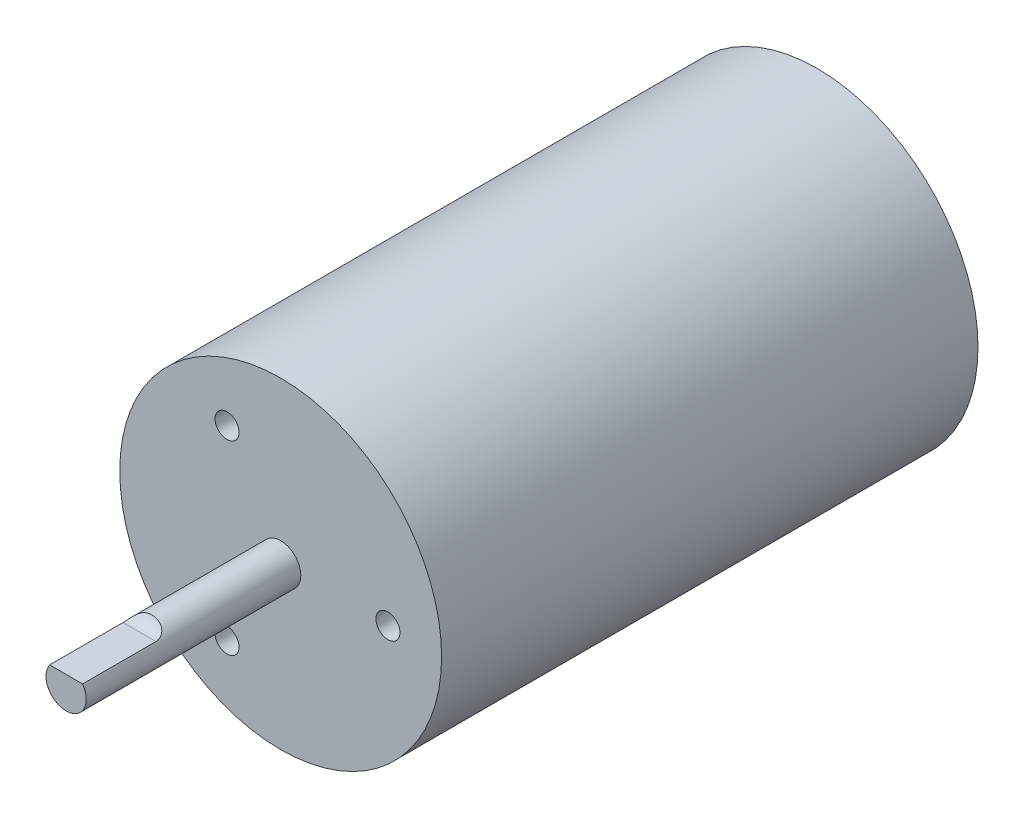
ISO-10303-21;
HEADER;
FILE_DESCRIPTION(('STEP AP214'),'2;1');
FILE_NAME('part.step','',(''),(''),'','','');
FILE_SCHEMA(('AUTOMOTIVE_DESIGN { 1 0 10303 214 1 1 1 1 }'));
ENDSEC;
DATA;
#1=APPLICATION_CONTEXT('core data for automotive mechanical design processes');
#2=APPLICATION_PROTOCOL_DEFINITION('international standard','automotive_design',2000,#1);
#3=PRODUCT_CONTEXT('',#1,'mechanical');
#4=PRODUCT('Part','Part','',(#3));
#5=PRODUCT_RELATED_PRODUCT_CATEGORY('part','',(#4));
#6=PRODUCT_DEFINITION_FORMATION('','',#4);
#7=PRODUCT_DEFINITION_CONTEXT('part definition',#1,'design');
#8=PRODUCT_DEFINITION('design','',#6,#7);
#9=PRODUCT_DEFINITION_SHAPE('','',#8);
#10=(LENGTH_UNIT() NAMED_UNIT(*) SI_UNIT(.MILLI.,.METRE.));
#11=(NAMED_UNIT(*) PLANE_ANGLE_UNIT() SI_UNIT($,.RADIAN.));
#12=(NAMED_UNIT(*) SI_UNIT($,.STERADIAN.) SOLID_ANGLE_UNIT());
#13=UNCERTAINTY_MEASURE_WITH_UNIT(LENGTH_MEASURE(1.E-05),#10,'distance_accuracy_value','');
#14=(GEOMETRIC_REPRESENTATION_CONTEXT(3) GLOBAL_UNCERTAINTY_ASSIGNED_CONTEXT((#13)) GLOBAL_UNIT_ASSIGNED_CONTEXT((#10,
#11,#12)) REPRESENTATION_CONTEXT('',''));
#15=CARTESIAN_POINT('',(0.,0.,0.));
#16=DIRECTION('',(0.,0.,1.));
#17=DIRECTION('',(1.,0.,0.));
#18=AXIS2_PLACEMENT_3D('',#15,#16,#17);
#19=CARTESIAN_POINT('',(0.,0.,25.4));
#20=DIRECTION('',(0.,0.,-1.));
#21=DIRECTION('',(-1.,0.,0.));
#22=AXIS2_PLACEMENT_3D('',#19,#20,#21);
#23=CYLINDRICAL_SURFACE('',#22,2.38125);
#24=CARTESIAN_POINT('',(0.,0.,0.));
#25=DIRECTION('',(0.,0.,1.));
#26=DIRECTION('',(1.,0.,0.));
#27=AXIS2_PLACEMENT_3D('',#24,#25,#26);
#28=CIRCLE('',#27,2.38125);
#29=CARTESIAN_POINT('',(2.38125,0.,0.));
#30=VERTEX_POINT('',#29);
#31=EDGE_CURVE('E121',#30,#30,#28,.T.);
#32=ORIENTED_EDGE('',*,*,#31,.T.);
#33=EDGE_LOOP('',(#32));
#34=FACE_BOUND('',#33,.T.);
#35=DIRECTION('',(0.,0.,-1.));
#36=VECTOR('',#35,1.);
#37=CARTESIAN_POINT('',(1.95101101995863,1.36525,25.4));
#38=LINE('',#37,#36);
#39=CARTESIAN_POINT('',(1.95101101995862,1.36525,25.4));
#40=VERTEX_POINT('',#39);
#41=CARTESIAN_POINT('',(1.95101101995863,1.36525,16.7145579900178));
#42=VERTEX_POINT('',#41);
#43=EDGE_CURVE('E118',#40,#42,#38,.T.);
#44=ORIENTED_EDGE('',*,*,#43,.F.);
#45=CARTESIAN_POINT('',(0.,0.,25.4));
#46=DIRECTION('',(0.,0.,1.));
#47=DIRECTION('',(1.,0.,0.));
#48=AXIS2_PLACEMENT_3D('',#45,#46,#47);
#49=CIRCLE('',#48,2.38125);
#50=CARTESIAN_POINT('',(-1.95101101995863,1.36525,25.4));
#51=VERTEX_POINT('',#50);
#52=EDGE_CURVE('E124',#51,#40,#49,.T.);
#53=ORIENTED_EDGE('',*,*,#52,.F.);
#54=DIRECTION('',(0.,0.,-1.));
#55=VECTOR('',#54,1.);
#56=CARTESIAN_POINT('',(-1.95101101995863,1.36525,25.4));
#57=LINE('',#56,#55);
#58=CARTESIAN_POINT('',(-1.95101101995863,1.36525,16.7145579900178));
#59=VERTEX_POINT('',#58);
#60=EDGE_CURVE('E52',#59,#51,#57,.F.);
#61=ORIENTED_EDGE('',*,*,#60,.F.);
#62=CARTESIAN_POINT('',(0.,2.38125,18.2021338604154));
#63=CARTESIAN_POINT('',(0.0676337390892533,2.38125004038805,18.2021340301931));
#64=CARTESIAN_POINT('',(0.135269511029242,2.37836555789325,18.2010306236303));
#65=CARTESIAN_POINT('',(0.270011360928685,2.36685874309445,18.1965130613484));
#66=CARTESIAN_POINT('',(0.337117123411539,2.35823322088689,18.1930976209721));
#67=CARTESIAN_POINT('',(0.470257837474709,2.33533172721854,18.183640662292));
#68=CARTESIAN_POINT('',(0.536291474315607,2.32104929415824,18.177596140145));
#69=CARTESIAN_POINT('',(0.66653589993214,2.28705362939443,18.162373995333));
#70=CARTESIAN_POINT('',(0.730747514163267,2.26734290171695,18.1531978168086));
#71=CARTESIAN_POINT('',(0.88660018088489,2.21223044891665,18.1257625793209));
#72=CARTESIAN_POINT('',(0.976824193453154,2.17381898366358,18.1052599970066));
#73=CARTESIAN_POINT('',(1.14920263009543,2.08780234529021,18.05319043776));
#74=CARTESIAN_POINT('',(1.23137509285807,2.04021846693878,18.02164895314));
#75=CARTESIAN_POINT('',(1.37109639269111,1.94836725432783,17.9515525632758));
#76=CARTESIAN_POINT('',(1.43041264999228,1.90505142677011,17.9152910084767));
#77=CARTESIAN_POINT('',(1.54029797286534,1.81735164799252,17.8322342170101));
#78=CARTESIAN_POINT('',(1.59087051316971,1.77296812909531,17.785443181826));
#79=CARTESIAN_POINT('',(1.6823817468959,1.68639975259534,17.680843153957));
#80=CARTESIAN_POINT('',(1.72326674225026,1.64422811476951,17.6229758216141));
#81=CARTESIAN_POINT('',(1.7946071174476,1.5660631107048,17.4974364784272));
#82=CARTESIAN_POINT('',(1.82506398055243,1.53006886617818,17.4297658639188));
#83=CARTESIAN_POINT('',(1.87336999193195,1.47043209417024,17.2937014834466));
#84=CARTESIAN_POINT('',(1.89215407693118,1.44593127697069,17.2260115984628));
#85=CARTESIAN_POINT('',(1.9219202362663,1.40612822191781,17.0863458446711));
#86=CARTESIAN_POINT('',(1.93290276275456,1.39082545098425,17.0143702245122));
#87=CARTESIAN_POINT('',(1.9473313333111,1.37054914050015,16.8696573421284));
#88=CARTESIAN_POINT('',(1.95091629480561,1.36538529574901,16.7969603816717));
#89=CARTESIAN_POINT('',(1.9511199588155,1.36509439238449,16.6515363047512));
#90=CARTESIAN_POINT('',(1.94773877377115,1.36996717177041,16.578809188793));
#91=CARTESIAN_POINT('',(1.93382894933259,1.3895324656453,16.4349851190824));
#92=CARTESIAN_POINT('',(1.92326232304367,1.40427716306186,16.3638989158012));
#93=CARTESIAN_POINT('',(1.89455959938443,1.44276376248764,16.2258170097998));
#94=CARTESIAN_POINT('',(1.876424807457,1.46650411275984,16.1588206039085));
#95=CARTESIAN_POINT('',(1.83225350350026,1.5213231148118,16.0311285876231));
#96=CARTESIAN_POINT('',(1.80625669773554,1.55236472122393,15.9704033263711));
#97=CARTESIAN_POINT('',(1.74609923050631,1.61972821743737,15.8564111440915));
#98=CARTESIAN_POINT('',(1.71193971958711,1.65604936279752,15.8031431736243));
#99=CARTESIAN_POINT('',(1.6352650384023,1.73181525398459,15.7044954263309));
#100=CARTESIAN_POINT('',(1.59267222383557,1.77128682104026,15.6591969549095));
#101=CARTESIAN_POINT('',(1.50001394356688,1.85041147125619,15.5772631620321));
#102=CARTESIAN_POINT('',(1.44994585193904,1.89006461343658,15.5406308965872));
#103=CARTESIAN_POINT('',(1.33867697141842,1.97063756747771,15.4726026413069));
#104=CARTESIAN_POINT('',(1.2768845733783,2.01136260797288,15.4419494138771));
#105=CARTESIAN_POINT('',(1.14715399927818,2.08808165520601,15.3888851380576));
#106=CARTESIAN_POINT('',(1.07921203002995,2.12407270788088,15.3664792205503));
#107=CARTESIAN_POINT('',(0.925450944887935,2.19598984542352,15.3248090348767));
#108=CARTESIAN_POINT('',(0.838665978771189,2.23064285447445,15.3069177740739));
#109=CARTESIAN_POINT('',(0.660561821115633,2.28972464018676,15.2782759624298));
#110=CARTESIAN_POINT('',(0.569239564749793,2.31414639790945,15.2675303107276));
#111=CARTESIAN_POINT('',(0.365579121000406,2.35574290345574,15.2498849823858));
#112=CARTESIAN_POINT('',(0.252649188677733,2.37053740161292,15.2441622920506));
#113=CARTESIAN_POINT('',(0.0255759890467969,2.38382869735669,15.2389891098672));
#114=CARTESIAN_POINT('',(-0.0885682507770203,2.3823112663561,15.2395440939378));
#115=CARTESIAN_POINT('',(-0.263669697596858,2.36742333165003,15.2454046400106));
#116=CARTESIAN_POINT('',(-0.325244182592446,2.35974759264995,15.2484387693907));
#117=CARTESIAN_POINT('',(-0.447489306463699,2.33964483655482,15.2566908512497));
#118=CARTESIAN_POINT('',(-0.508159811480049,2.32721712292179,15.2619091238879));
#119=CARTESIAN_POINT('',(-0.628061889552236,2.29775925601969,15.2748929819252));
#120=CARTESIAN_POINT('',(-0.687294287366122,2.28073181207507,15.2826570683677));
#121=CARTESIAN_POINT('',(-0.803811247876481,2.24232141891076,15.3012361233809));
#122=CARTESIAN_POINT('',(-0.861096405207311,2.22093981353331,15.3120501510315));
#123=CARTESIAN_POINT('',(-1.0030491529141,2.16168413667972,15.3440892940988));
#124=CARTESIAN_POINT('',(-1.08606887201268,2.12108800042828,15.3677924053669));
#125=CARTESIAN_POINT('',(-1.24380132150032,2.03259846016371,15.42634827397));
#126=CARTESIAN_POINT('',(-1.3185279968726,1.98471763723567,15.4611819201893));
#127=CARTESIAN_POINT('',(-1.44590576237233,1.89336198556923,15.5375083843671));
#128=CARTESIAN_POINT('',(-1.50016769725143,1.85045099162037,15.5769744294605));
#129=CARTESIAN_POINT('',(-1.59992011436614,1.76491369433418,15.6660624600443));
#130=CARTESIAN_POINT('',(-1.64541402601793,1.72228728601084,15.7156804591061));
#131=CARTESIAN_POINT('',(-1.72699779177844,1.64048611648962,15.8250586004782));
#132=CARTESIAN_POINT('',(-1.76304647485138,1.60132694359926,15.8848613298396));
#133=CARTESIAN_POINT('',(-1.82534507835508,1.52994313602238,16.0131153421078));
#134=CARTESIAN_POINT('',(-1.85159478234316,1.497718654518,16.081566816006));
#135=CARTESIAN_POINT('',(-1.89300856860936,1.44496016409858,16.2192920748628));
#136=CARTESIAN_POINT('',(-1.90888049778225,1.42370761609776,16.2880805176647));
#137=CARTESIAN_POINT('',(-1.93311594986609,1.39062526166919,16.4291562372548));
#138=CARTESIAN_POINT('',(-1.94147986789517,1.3787949593881,16.5014433297115));
#139=CARTESIAN_POINT('',(-1.95098399307532,1.36531351806619,16.6467555353043));
#140=CARTESIAN_POINT('',(-1.95218918988168,1.36357080368637,16.7197679618902));
#141=CARTESIAN_POINT('',(-1.9476026893249,1.3701134412389,16.8651213227609));
#142=CARTESIAN_POINT('',(-1.94181110765418,1.37839862735895,16.9374622681287));
#143=CARTESIAN_POINT('',(-1.92295321948591,1.40458590919274,17.0797271750206));
#144=CARTESIAN_POINT('',(-1.90985652758389,1.42252816220973,17.1496397368537));
#145=CARTESIAN_POINT('',(-1.87593971989845,1.46696193869372,17.2846988748934));
#146=CARTESIAN_POINT('',(-1.85512126580502,1.49345162263098,17.3498464728913));
#147=CARTESIAN_POINT('',(-1.80550073151972,1.55306326989195,17.4732225423686));
#148=CARTESIAN_POINT('',(-1.77674533164452,1.5861461491119,17.5314887095193));
#149=CARTESIAN_POINT('',(-1.71109243185906,1.65675286045595,17.6401893339891));
#150=CARTESIAN_POINT('',(-1.67419532493578,1.69427647819228,17.6906241691137));
#151=CARTESIAN_POINT('',(-1.59185229532183,1.77189431388369,17.7838555364103));
#152=CARTESIAN_POINT('',(-1.5462619751101,1.81202305914972,17.8264949880159));
#153=CARTESIAN_POINT('',(-1.44782512602837,1.89160336407494,17.9031036877713));
#154=CARTESIAN_POINT('',(-1.39497610275647,1.93105468567645,17.9370699439168));
#155=CARTESIAN_POINT('',(-1.27721453127501,2.01113423584475,18.0002927703995));
#156=CARTESIAN_POINT('',(-1.21161712248837,2.05144445278522,18.0286693166908));
#157=CARTESIAN_POINT('',(-1.07449080376152,2.1264876711186,18.0773388754597));
#158=CARTESIAN_POINT('',(-1.00295632002388,2.16121533965296,18.0976241856707));
#159=CARTESIAN_POINT('',(-0.840803145836919,2.22993580009133,18.1351201135437));
#160=CARTESIAN_POINT('',(-0.74921692496152,2.2624111552077,18.1509186541577));
#161=CARTESIAN_POINT('',(-0.561984057189917,2.3160338022742,18.1755904856698));
#162=CARTESIAN_POINT('',(-0.466339804690519,2.33718767671616,18.1844678020539));
#163=CARTESIAN_POINT('',(-0.308621116617282,2.36197563320509,18.194584575773));
#164=CARTESIAN_POINT('',(-0.247181583678173,2.36919414201254,18.1974336338092));
#165=CARTESIAN_POINT('',(-0.123828755529014,2.37883256139703,18.2012087011461));
#166=CARTESIAN_POINT('',(-0.0619152295763523,2.38124996302681,18.2021337049926));
#167=CARTESIAN_POINT('',(0.,2.38125,18.2021338604154));
#168=B_SPLINE_CURVE_WITH_KNOTS('',3,(#62,#63,#64,#65,#66,#67,#68,#69,#70,#71,#72,#73,#74,#75,
#76,#77,#78,#79,#80,#81,#82,#83,#84,#85,#86,#87,#88,#89,#90,#91,#92,#93,#94,#95,#96,#97,#98,#99,
#100,#101,#102,#103,#104,#105,#106,#107,#108,#109,#110,#111,#112,#113,#114,#115,#116,#117,#118,
#119,#120,#121,#122,#123,#124,#125,#126,#127,#128,#129,#130,#131,#132,#133,#134,#135,#136,#137,
#138,#139,#140,#141,#142,#143,#144,#145,#146,#147,#148,#149,#150,#151,#152,#153,#154,#155,#156,
#157,#158,#159,#160,#161,#162,#163,#164,#165,#166,#167),.UNSPECIFIED.,.T.,.F.,(4,2,2,2,2,2,2,2,
2,2,2,2,2,2,2,2,2,2,2,2,2,2,2,2,2,2,2,2,2,2,2,2,2,2,2,2,2,2,2,2,2,2,2,2,2,2,2,2,2,2,2,2,4),(0.,
0.202833529407158,0.405779853736744,0.608958664904554,0.812043907955549,1.11134164679719,
1.40995272427208,1.65466777135272,1.89928534460164,2.14522867249997,2.39113700371424,
2.61324514392157,2.83534041042994,3.05322556994325,3.27110721260958,3.49014976670914,
3.70915455347579,3.92707124495892,4.14495723886231,4.36495130295655,4.58502282949817,
4.82442842390453,5.06398270850466,5.34837534744,5.63296276984527,5.97369493793818,
6.31472434435473,6.50090828324036,6.6871195231825,6.8732213195899,7.05926576547058,
7.34429833212378,7.62884410447092,7.86675926175323,8.10458117415067,8.34342310834323,
8.58227031783353,8.80238918041606,9.022496458299,9.24060242510722,9.45870478556112,
9.67772117554678,9.89669046146703,10.1143983798147,10.3320957920527,10.5537864643054,
10.7755535104888,11.0208120803435,11.2663035644509,11.5605794376572,11.8546840277285,
12.0402707938341,12.2259545177881),.UNSPECIFIED.);
#169=EDGE_CURVE('E11',#42,#59,#168,.T.);
#170=ORIENTED_EDGE('',*,*,#169,.F.);
#171=EDGE_LOOP('',(#44,#53,#61,#170));
#172=FACE_BOUND('',#171,.T.);
#173=ADVANCED_FACE('F33',(#34,#172),#23,.T.);
#174=CARTESIAN_POINT('',(0.,0.,25.4));
#175=DIRECTION('',(0.,0.,1.));
#176=DIRECTION('',(1.,0.,0.));
#177=AXIS2_PLACEMENT_3D('',#174,#175,#176);
#178=PLANE('',#177);
#179=ORIENTED_EDGE('',*,*,#52,.T.);
#180=DIRECTION('',(-1.,0.,0.));
#181=VECTOR('',#180,1.);
#182=CARTESIAN_POINT('',(0.,1.36525,25.4));
#183=LINE('',#182,#181);
#184=EDGE_CURVE('E45',#40,#51,#183,.T.);
#185=ORIENTED_EDGE('',*,*,#184,.T.);
#186=EDGE_LOOP('',(#179,#185));
#187=FACE_BOUND('',#186,.T.);
#188=ADVANCED_FACE('F134',(#187),#178,.T.);
#189=CARTESIAN_POINT('',(0.,0.,0.));
#190=DIRECTION('',(0.,0.,1.));
#191=DIRECTION('',(1.,0.,0.));
#192=AXIS2_PLACEMENT_3D('',#189,#190,#191);
#193=PLANE('',#192);
#194=CARTESIAN_POINT('',(-6.3499999999999,-10.9985226280624,0.));
#195=DIRECTION('',(0.,0.,1.));
#196=DIRECTION('',(1.,0.,0.));
#197=AXIS2_PLACEMENT_3D('',#194,#195,#196);
#198=CIRCLE('',#197,1.42239999999999);
#199=CARTESIAN_POINT('',(-4.9275999999999,-10.9985226280624,0.));
#200=VERTEX_POINT('',#199);
#201=EDGE_CURVE('E88',#200,#200,#198,.T.);
#202=ORIENTED_EDGE('',*,*,#201,.F.);
#203=EDGE_LOOP('',(#202));
#204=FACE_BOUND('',#203,.T.);
#205=CARTESIAN_POINT('',(-6.35000000000005,10.9985226280623,0.));
#206=DIRECTION('',(0.,0.,1.));
#207=DIRECTION('',(1.,0.,0.));
#208=AXIS2_PLACEMENT_3D('',#205,#206,#207);
#209=CIRCLE('',#208,1.42239999999999);
#210=CARTESIAN_POINT('',(-4.92760000000006,10.9985226280623,0.));
#211=VERTEX_POINT('',#210);
#212=EDGE_CURVE('E100',#211,#211,#209,.T.);
#213=ORIENTED_EDGE('',*,*,#212,.F.);
#214=EDGE_LOOP('',(#213));
#215=FACE_BOUND('',#214,.T.);
#216=CARTESIAN_POINT('',(12.7,0.,0.));
#217=DIRECTION('',(0.,0.,1.));
#218=DIRECTION('',(1.,0.,0.));
#219=AXIS2_PLACEMENT_3D('',#216,#217,#218);
#220=CIRCLE('',#219,1.42239999999999);
#221=CARTESIAN_POINT('',(14.1224,0.,0.));
#222=VERTEX_POINT('',#221);
#223=EDGE_CURVE('E112',#222,#222,#220,.T.);
#224=ORIENTED_EDGE('',*,*,#223,.F.);
#225=EDGE_LOOP('',(#224));
#226=FACE_BOUND('',#225,.T.);
#227=CARTESIAN_POINT('',(0.,0.,0.));
#228=DIRECTION('',(0.,0.,1.));
#229=DIRECTION('',(1.,0.,0.));
#230=AXIS2_PLACEMENT_3D('',#227,#228,#229);
#231=CIRCLE('',#230,19.05);
#232=CARTESIAN_POINT('',(19.05,0.,0.));
#233=VERTEX_POINT('',#232);
#234=EDGE_CURVE('E127',#233,#233,#231,.T.);
#235=ORIENTED_EDGE('',*,*,#234,.T.);
#236=EDGE_LOOP('',(#235));
#237=FACE_BOUND('',#236,.T.);
#238=ORIENTED_EDGE('',*,*,#31,.F.);
#239=EDGE_LOOP('',(#238));
#240=FACE_BOUND('',#239,.T.);
#241=ADVANCED_FACE('F155',(#204,#215,#226,#237,#240),#193,.T.);
#242=CARTESIAN_POINT('',(0.,0.,-63.5));
#243=DIRECTION('',(0.,0.,1.));
#244=DIRECTION('',(1.,0.,0.));
#245=AXIS2_PLACEMENT_3D('',#242,#243,#244);
#246=CYLINDRICAL_SURFACE('',#245,19.05);
#247=CARTESIAN_POINT('',(0.,0.,-63.5));
#248=DIRECTION('',(0.,0.,1.));
#249=DIRECTION('',(1.,0.,0.));
#250=AXIS2_PLACEMENT_3D('',#247,#248,#249);
#251=CIRCLE('',#250,19.05);
#252=CARTESIAN_POINT('',(19.05,0.,-63.5));
#253=VERTEX_POINT('',#252);
#254=EDGE_CURVE('E130',#253,#253,#251,.T.);
#255=ORIENTED_EDGE('',*,*,#254,.T.);
#256=EDGE_LOOP('',(#255));
#257=FACE_BOUND('',#256,.T.);
#258=ORIENTED_EDGE('',*,*,#234,.F.);
#259=EDGE_LOOP('',(#258));
#260=FACE_BOUND('',#259,.T.);
#261=ADVANCED_FACE('F35',(#257,#260),#246,.T.);
#262=CARTESIAN_POINT('',(0.,0.,-63.5));
#263=DIRECTION('',(0.,0.,1.));
#264=DIRECTION('',(1.,0.,0.));
#265=AXIS2_PLACEMENT_3D('',#262,#263,#264);
#266=PLANE('',#265);
#267=ORIENTED_EDGE('',*,*,#254,.F.);
#268=EDGE_LOOP('',(#267));
#269=FACE_BOUND('',#268,.T.);
#270=ADVANCED_FACE('F140',(#269),#266,.F.);
#271=CARTESIAN_POINT('',(153.754975253475,2.95273665622663,16.7210669302077));
#272=DIRECTION('',(-1.,0.,0.));
#273=DIRECTION('',(0.,0.,1.));
#274=AXIS2_PLACEMENT_3D('',#271,#272,#273);
#275=CYLINDRICAL_SURFACE('',#274,1.5875);
#276=DIRECTION('',(-1.,0.,0.));
#277=VECTOR('',#276,1.);
#278=CARTESIAN_POINT('',(153.754975253475,1.36525,16.7145579900178));
#279=LINE('',#278,#277);
#280=EDGE_CURVE('E115',#42,#59,#279,.T.);
#281=ORIENTED_EDGE('',*,*,#280,.F.);
#282=ORIENTED_EDGE('',*,*,#169,.T.);
#283=EDGE_LOOP('',(#281,#282));
#284=FACE_BOUND('',#283,.T.);
#285=ADVANCED_FACE('F138',(#284),#275,.F.);
#286=CARTESIAN_POINT('',(153.754975253475,1.36525,25.4));
#287=DIRECTION('',(0.,1.,0.));
#288=DIRECTION('',(0.,0.,1.));
#289=AXIS2_PLACEMENT_3D('',#286,#287,#288);
#290=PLANE('',#289);
#291=ORIENTED_EDGE('',*,*,#184,.F.);
#292=ORIENTED_EDGE('',*,*,#43,.T.);
#293=ORIENTED_EDGE('',*,*,#280,.T.);
#294=ORIENTED_EDGE('',*,*,#60,.T.);
#295=EDGE_LOOP('',(#291,#292,#293,#294));
#296=FACE_BOUND('',#295,.T.);
#297=ADVANCED_FACE('F137',(#296),#290,.T.);
#298=CARTESIAN_POINT('',(12.7,0.,0.));
#299=DIRECTION('',(0.,0.,1.));
#300=DIRECTION('',(1.,0.,0.));
#301=AXIS2_PLACEMENT_3D('',#298,#299,#300);
#302=CYLINDRICAL_SURFACE('',#301,1.42239999999999);
#303=CARTESIAN_POINT('',(12.7,0.,-5.6896));
#304=DIRECTION('',(0.,0.,1.));
#305=DIRECTION('',(1.,0.,0.));
#306=AXIS2_PLACEMENT_3D('',#303,#304,#305);
#307=CIRCLE('',#306,1.4224);
#308=CARTESIAN_POINT('',(14.1224,0.,-5.6896));
#309=VERTEX_POINT('',#308);
#310=EDGE_CURVE('E109',#309,#309,#307,.T.);
#311=ORIENTED_EDGE('',*,*,#310,.F.);
#312=EDGE_LOOP('',(#311));
#313=FACE_BOUND('',#312,.T.);
#314=ORIENTED_EDGE('',*,*,#223,.T.);
#315=EDGE_LOOP('',(#314));
#316=FACE_BOUND('',#315,.T.);
#317=ADVANCED_FACE('F145',(#313,#316),#302,.F.);
#318=CARTESIAN_POINT('',(13.8303,0.,-5.6896));
#319=DIRECTION('',(0.,0.,-1.));
#320=DIRECTION('',(-1.,0.,0.));
#321=AXIS2_PLACEMENT_3D('',#318,#319,#320);
#322=PLANE('',#321);
#323=CARTESIAN_POINT('',(12.7,0.,-5.6896));
#324=DIRECTION('',(0.,0.,1.));
#325=DIRECTION('',(1.,0.,0.));
#326=AXIS2_PLACEMENT_3D('',#323,#324,#325);
#327=CIRCLE('',#326,1.1303);
#328=CARTESIAN_POINT('',(13.8303,0.,-5.6896));
#329=VERTEX_POINT('',#328);
#330=EDGE_CURVE('E106',#329,#329,#327,.T.);
#331=ORIENTED_EDGE('',*,*,#330,.F.);
#332=EDGE_LOOP('',(#331));
#333=FACE_BOUND('',#332,.T.);
#334=ORIENTED_EDGE('',*,*,#310,.T.);
#335=EDGE_LOOP('',(#334));
#336=FACE_BOUND('',#335,.T.);
#337=ADVANCED_FACE('F177',(#333,#336),#322,.F.);
#338=CARTESIAN_POINT('',(12.7,0.,0.));
#339=DIRECTION('',(0.,0.,1.));
#340=DIRECTION('',(1.,0.,0.));
#341=AXIS2_PLACEMENT_3D('',#338,#339,#340);
#342=CYLINDRICAL_SURFACE('',#341,1.1303);
#343=CARTESIAN_POINT('',(12.7,0.,-8.8646));
#344=DIRECTION('',(0.,0.,1.));
#345=DIRECTION('',(1.,0.,0.));
#346=AXIS2_PLACEMENT_3D('',#343,#344,#345);
#347=CIRCLE('',#346,1.1303);
#348=CARTESIAN_POINT('',(13.8303,0.,-8.8646));
#349=VERTEX_POINT('',#348);
#350=EDGE_CURVE('E103',#349,#349,#347,.T.);
#351=ORIENTED_EDGE('',*,*,#350,.F.);
#352=EDGE_LOOP('',(#351));
#353=FACE_BOUND('',#352,.T.);
#354=ORIENTED_EDGE('',*,*,#330,.T.);
#355=EDGE_LOOP('',(#354));
#356=FACE_BOUND('',#355,.T.);
#357=ADVANCED_FACE('F182',(#353,#356),#342,.F.);
#358=CARTESIAN_POINT('',(12.7,0.,-8.8646));
#359=DIRECTION('',(0.,0.,1.));
#360=DIRECTION('',(1.,0.,0.));
#361=AXIS2_PLACEMENT_3D('',#358,#359,#360);
#362=CONICAL_SURFACE('',#361,1.1303,1.02974425867665);
#363=CARTESIAN_POINT('',(12.7,0.,-9.54375275768685));
#364=VERTEX_POINT('',#363);
#365=VERTEX_LOOP('',#364);
#366=FACE_BOUND('',#365,.T.);
#367=ORIENTED_EDGE('',*,*,#350,.T.);
#368=EDGE_LOOP('',(#367));
#369=FACE_BOUND('',#368,.T.);
#370=ADVANCED_FACE('F189',(#366,#369),#362,.F.);
#371=CARTESIAN_POINT('',(-6.35000000000005,10.9985226280623,0.));
#372=DIRECTION('',(0.,0.,1.));
#373=DIRECTION('',(1.,0.,0.));
#374=AXIS2_PLACEMENT_3D('',#371,#372,#373);
#375=CYLINDRICAL_SURFACE('',#374,1.42239999999999);
#376=CARTESIAN_POINT('',(-6.35000000000005,10.9985226280623,-5.6896));
#377=DIRECTION('',(0.,0.,1.));
#378=DIRECTION('',(1.,0.,0.));
#379=AXIS2_PLACEMENT_3D('',#376,#377,#378);
#380=CIRCLE('',#379,1.4224);
#381=CARTESIAN_POINT('',(-4.92760000000006,10.9985226280623,-5.6896));
#382=VERTEX_POINT('',#381);
#383=EDGE_CURVE('E97',#382,#382,#380,.T.);
#384=ORIENTED_EDGE('',*,*,#383,.F.);
#385=EDGE_LOOP('',(#384));
#386=FACE_BOUND('',#385,.T.);
#387=ORIENTED_EDGE('',*,*,#212,.T.);
#388=EDGE_LOOP('',(#387));
#389=FACE_BOUND('',#388,.T.);
#390=ADVANCED_FACE('F193',(#386,#389),#375,.F.);
#391=CARTESIAN_POINT('',(-5.21970000000005,10.9985226280623,-5.6896));
#392=DIRECTION('',(0.,0.,-1.));
#393=DIRECTION('',(-1.,0.,0.));
#394=AXIS2_PLACEMENT_3D('',#391,#392,#393);
#395=PLANE('',#394);
#396=CARTESIAN_POINT('',(-6.35000000000005,10.9985226280623,-5.6896));
#397=DIRECTION('',(0.,0.,1.));
#398=DIRECTION('',(1.,0.,0.));
#399=AXIS2_PLACEMENT_3D('',#396,#397,#398);
#400=CIRCLE('',#399,1.1303);
#401=CARTESIAN_POINT('',(-5.21970000000005,10.9985226280623,-5.6896));
#402=VERTEX_POINT('',#401);
#403=EDGE_CURVE('E94',#402,#402,#400,.T.);
#404=ORIENTED_EDGE('',*,*,#403,.F.);
#405=EDGE_LOOP('',(#404));
#406=FACE_BOUND('',#405,.T.);
#407=ORIENTED_EDGE('',*,*,#383,.T.);
#408=EDGE_LOOP('',(#407));
#409=FACE_BOUND('',#408,.T.);
#410=ADVANCED_FACE('F197',(#406,#409),#395,.F.);
#411=CARTESIAN_POINT('',(-6.35000000000005,10.9985226280623,0.));
#412=DIRECTION('',(0.,0.,1.));
#413=DIRECTION('',(1.,0.,0.));
#414=AXIS2_PLACEMENT_3D('',#411,#412,#413);
#415=CYLINDRICAL_SURFACE('',#414,1.1303);
#416=CARTESIAN_POINT('',(-6.35000000000005,10.9985226280623,-8.8646));
#417=DIRECTION('',(0.,0.,1.));
#418=DIRECTION('',(1.,0.,0.));
#419=AXIS2_PLACEMENT_3D('',#416,#417,#418);
#420=CIRCLE('',#419,1.1303);
#421=CARTESIAN_POINT('',(-5.21970000000005,10.9985226280623,-8.8646));
#422=VERTEX_POINT('',#421);
#423=EDGE_CURVE('E91',#422,#422,#420,.T.);
#424=ORIENTED_EDGE('',*,*,#423,.F.);
#425=EDGE_LOOP('',(#424));
#426=FACE_BOUND('',#425,.T.);
#427=ORIENTED_EDGE('',*,*,#403,.T.);
#428=EDGE_LOOP('',(#427));
#429=FACE_BOUND('',#428,.T.);
#430=ADVANCED_FACE('F201',(#426,#429),#415,.F.);
#431=CARTESIAN_POINT('',(-6.35000000000005,10.9985226280623,-8.8646));
#432=DIRECTION('',(0.,0.,1.));
#433=DIRECTION('',(1.,0.,0.));
#434=AXIS2_PLACEMENT_3D('',#431,#432,#433);
#435=CONICAL_SURFACE('',#434,1.1303,1.02974425867665);
#436=CARTESIAN_POINT('',(-6.35000000000005,10.9985226280623,-9.54375275768685));
#437=VERTEX_POINT('',#436);
#438=VERTEX_LOOP('',#437);
#439=FACE_BOUND('',#438,.T.);
#440=ORIENTED_EDGE('',*,*,#423,.T.);
#441=EDGE_LOOP('',(#440));
#442=FACE_BOUND('',#441,.T.);
#443=ADVANCED_FACE('F205',(#439,#442),#435,.F.);
#444=CARTESIAN_POINT('',(-6.3499999999999,-10.9985226280624,0.));
#445=DIRECTION('',(0.,0.,1.));
#446=DIRECTION('',(1.,0.,0.));
#447=AXIS2_PLACEMENT_3D('',#444,#445,#446);
#448=CYLINDRICAL_SURFACE('',#447,1.42239999999999);
#449=CARTESIAN_POINT('',(-6.3499999999999,-10.9985226280624,-5.6896));
#450=DIRECTION('',(0.,0.,1.));
#451=DIRECTION('',(1.,0.,0.));
#452=AXIS2_PLACEMENT_3D('',#449,#450,#451);
#453=CIRCLE('',#452,1.4224);
#454=CARTESIAN_POINT('',(-4.9275999999999,-10.9985226280624,-5.6896));
#455=VERTEX_POINT('',#454);
#456=EDGE_CURVE('E83',#455,#455,#453,.T.);
#457=ORIENTED_EDGE('',*,*,#456,.F.);
#458=EDGE_LOOP('',(#457));
#459=FACE_BOUND('',#458,.T.);
#460=ORIENTED_EDGE('',*,*,#201,.T.);
#461=EDGE_LOOP('',(#460));
#462=FACE_BOUND('',#461,.T.);
#463=ADVANCED_FACE('F209',(#459,#462),#448,.F.);
#464=CARTESIAN_POINT('',(-5.2196999999999,-10.9985226280624,-5.6896));
#465=DIRECTION('',(0.,0.,-1.));
#466=DIRECTION('',(-1.,0.,0.));
#467=AXIS2_PLACEMENT_3D('',#464,#465,#466);
#468=PLANE('',#467);
#469=CARTESIAN_POINT('',(-6.3499999999999,-10.9985226280624,-5.6896));
#470=DIRECTION('',(0.,0.,1.));
#471=DIRECTION('',(1.,0.,0.));
#472=AXIS2_PLACEMENT_3D('',#469,#470,#471);
#473=CIRCLE('',#472,1.1303);
#474=CARTESIAN_POINT('',(-5.2196999999999,-10.9985226280624,-5.6896));
#475=VERTEX_POINT('',#474);
#476=EDGE_CURVE('E80',#475,#475,#473,.T.);
#477=ORIENTED_EDGE('',*,*,#476,.F.);
#478=EDGE_LOOP('',(#477));
#479=FACE_BOUND('',#478,.T.);
#480=ORIENTED_EDGE('',*,*,#456,.T.);
#481=EDGE_LOOP('',(#480));
#482=FACE_BOUND('',#481,.T.);
#483=ADVANCED_FACE('F213',(#479,#482),#468,.F.);
#484=CARTESIAN_POINT('',(-6.3499999999999,-10.9985226280624,0.));
#485=DIRECTION('',(0.,0.,1.));
#486=DIRECTION('',(1.,0.,0.));
#487=AXIS2_PLACEMENT_3D('',#484,#485,#486);
#488=CYLINDRICAL_SURFACE('',#487,1.1303);
#489=CARTESIAN_POINT('',(-6.3499999999999,-10.9985226280624,-8.8646));
#490=DIRECTION('',(0.,0.,1.));
#491=DIRECTION('',(1.,0.,0.));
#492=AXIS2_PLACEMENT_3D('',#489,#490,#491);
#493=CIRCLE('',#492,1.1303);
#494=CARTESIAN_POINT('',(-5.2196999999999,-10.9985226280624,-8.8646));
#495=VERTEX_POINT('',#494);
#496=EDGE_CURVE('E78',#495,#495,#493,.T.);
#497=ORIENTED_EDGE('',*,*,#496,.F.);
#498=EDGE_LOOP('',(#497));
#499=FACE_BOUND('',#498,.T.);
#500=ORIENTED_EDGE('',*,*,#476,.T.);
#501=EDGE_LOOP('',(#500));
#502=FACE_BOUND('',#501,.T.);
#503=ADVANCED_FACE('F74',(#499,#502),#488,.F.);
#504=CARTESIAN_POINT('',(-6.3499999999999,-10.9985226280624,-8.8646));
#505=DIRECTION('',(0.,0.,1.));
#506=DIRECTION('',(1.,0.,0.));
#507=AXIS2_PLACEMENT_3D('',#504,#505,#506);
#508=CONICAL_SURFACE('',#507,1.1303,1.02974425867665);
#509=CARTESIAN_POINT('',(-6.3499999999999,-10.9985226280624,-9.54375275768685));
#510=VERTEX_POINT('',#509);
#511=VERTEX_LOOP('',#510);
#512=FACE_BOUND('',#511,.T.);
#513=ORIENTED_EDGE('',*,*,#496,.T.);
#514=EDGE_LOOP('',(#513));
#515=FACE_BOUND('',#514,.T.);
#516=ADVANCED_FACE('F71',(#512,#515),#508,.F.);
#517=CLOSED_SHELL('',(#173,#188,#241,#261,#270,#285,#297,#317,#337,#357,#370,#390,#410,#430,
#443,#463,#483,#503,#516));
#518=MANIFOLD_SOLID_BREP('B2',#517);
#519=ADVANCED_BREP_SHAPE_REPRESENTATION('',(#18,#518),#14);
#520=SHAPE_DEFINITION_REPRESENTATION(#9,#519);
ENDSEC;
END-ISO-10303-21;
